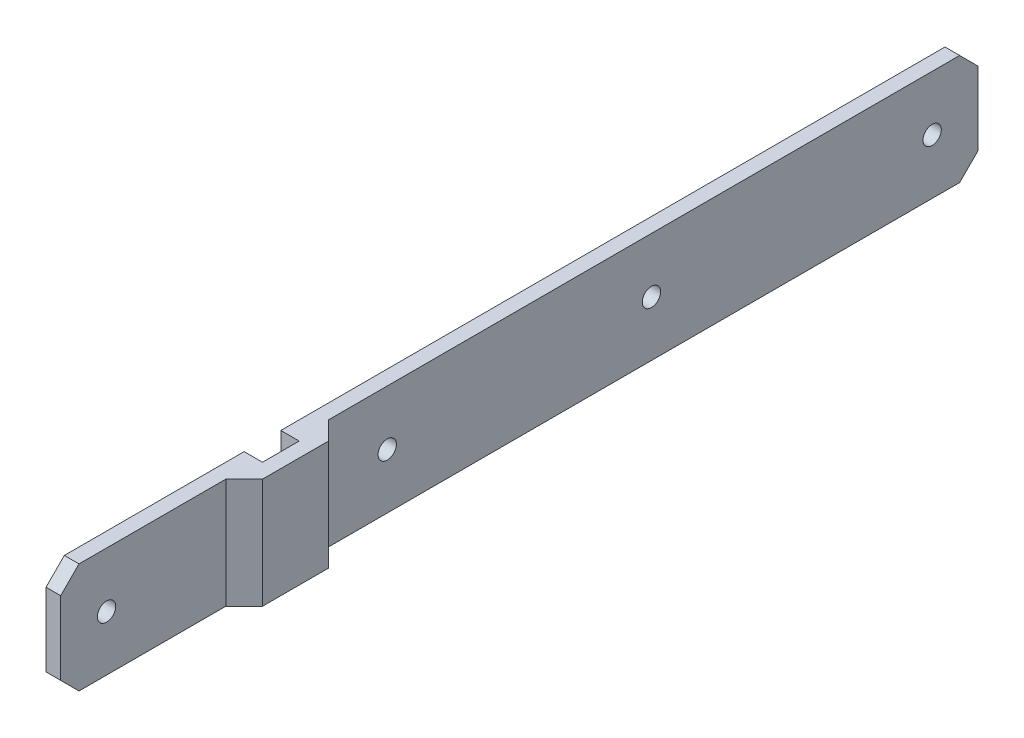
ISO-10303-21;
HEADER;
FILE_DESCRIPTION(('STEP AP214'),'2;1');
FILE_NAME('part.step','',(''),(''),'','','');
FILE_SCHEMA(('AUTOMOTIVE_DESIGN { 1 0 10303 214 1 1 1 1 }'));
ENDSEC;
DATA;
#1=APPLICATION_CONTEXT('core data for automotive mechanical design processes');
#2=APPLICATION_PROTOCOL_DEFINITION('international standard','automotive_design',2000,#1);
#3=PRODUCT_CONTEXT('',#1,'mechanical');
#4=PRODUCT('Part','Part','',(#3));
#5=PRODUCT_RELATED_PRODUCT_CATEGORY('part','',(#4));
#6=PRODUCT_DEFINITION_FORMATION('','',#4);
#7=PRODUCT_DEFINITION_CONTEXT('part definition',#1,'design');
#8=PRODUCT_DEFINITION('design','',#6,#7);
#9=PRODUCT_DEFINITION_SHAPE('','',#8);
#10=(LENGTH_UNIT() NAMED_UNIT(*) SI_UNIT(.MILLI.,.METRE.));
#11=(NAMED_UNIT(*) PLANE_ANGLE_UNIT() SI_UNIT($,.RADIAN.));
#12=(NAMED_UNIT(*) SI_UNIT($,.STERADIAN.) SOLID_ANGLE_UNIT());
#13=UNCERTAINTY_MEASURE_WITH_UNIT(LENGTH_MEASURE(1.E-05),#10,'distance_accuracy_value','');
#14=(GEOMETRIC_REPRESENTATION_CONTEXT(3) GLOBAL_UNCERTAINTY_ASSIGNED_CONTEXT((#13)) GLOBAL_UNIT_ASSIGNED_CONTEXT((#10,
#11,#12)) REPRESENTATION_CONTEXT('',''));
#15=CARTESIAN_POINT('',(0.,0.,0.));
#16=DIRECTION('',(0.,0.,1.));
#17=DIRECTION('',(1.,0.,0.));
#18=AXIS2_PLACEMENT_3D('',#15,#16,#17);
#19=CARTESIAN_POINT('',(5.,15.,0.));
#20=DIRECTION('',(0.,0.,-1.));
#21=DIRECTION('',(-1.,0.,0.));
#22=AXIS2_PLACEMENT_3D('',#19,#20,#21);
#23=PLANE('',#22);
#24=DIRECTION('',(1.,0.,0.));
#25=VECTOR('',#24,1.);
#26=CARTESIAN_POINT('',(5.,-15.,0.));
#27=LINE('',#26,#25);
#28=CARTESIAN_POINT('',(0.,-15.,0.));
#29=VERTEX_POINT('',#28);
#30=CARTESIAN_POINT('',(5.,-15.,0.));
#31=VERTEX_POINT('',#30);
#32=EDGE_CURVE('E184',#29,#31,#27,.T.);
#33=ORIENTED_EDGE('',*,*,#32,.T.);
#34=DIRECTION('',(0.,-1.,0.));
#35=VECTOR('',#34,1.);
#36=CARTESIAN_POINT('',(5.,15.,0.));
#37=LINE('',#36,#35);
#38=CARTESIAN_POINT('',(5.,15.,0.));
#39=VERTEX_POINT('',#38);
#40=EDGE_CURVE('E161',#39,#31,#37,.T.);
#41=ORIENTED_EDGE('',*,*,#40,.F.);
#42=DIRECTION('',(1.,0.,0.));
#43=VECTOR('',#42,1.);
#44=CARTESIAN_POINT('',(5.,15.,0.));
#45=LINE('',#44,#43);
#46=CARTESIAN_POINT('',(0.,15.,0.));
#47=VERTEX_POINT('',#46);
#48=EDGE_CURVE('E169',#47,#39,#45,.T.);
#49=ORIENTED_EDGE('',*,*,#48,.F.);
#50=DIRECTION('',(0.,-1.,0.));
#51=VECTOR('',#50,1.);
#52=CARTESIAN_POINT('',(0.,15.,0.));
#53=LINE('',#52,#51);
#54=EDGE_CURVE('E304',#47,#29,#53,.T.);
#55=ORIENTED_EDGE('',*,*,#54,.T.);
#56=EDGE_LOOP('',(#33,#41,#49,#55));
#57=FACE_BOUND('',#56,.T.);
#58=ADVANCED_FACE('F41',(#57),#23,.F.);
#59=CARTESIAN_POINT('',(5.,15.,10.));
#60=DIRECTION('',(1.,0.,0.));
#61=DIRECTION('',(0.,0.,-1.));
#62=AXIS2_PLACEMENT_3D('',#59,#60,#61);
#63=PLANE('',#62);
#64=DIRECTION('',(0.,0.,1.));
#65=VECTOR('',#64,1.);
#66=CARTESIAN_POINT('',(5.,-15.,10.));
#67=LINE('',#66,#65);
#68=CARTESIAN_POINT('',(5.,-15.,10.));
#69=VERTEX_POINT('',#68);
#70=EDGE_CURVE('E307',#31,#69,#67,.T.);
#71=ORIENTED_EDGE('',*,*,#70,.T.);
#72=DIRECTION('',(0.,-1.,0.));
#73=VECTOR('',#72,1.);
#74=CARTESIAN_POINT('',(5.,15.,10.));
#75=LINE('',#74,#73);
#76=CARTESIAN_POINT('',(5.,15.,10.));
#77=VERTEX_POINT('',#76);
#78=EDGE_CURVE('E164',#77,#69,#75,.T.);
#79=ORIENTED_EDGE('',*,*,#78,.F.);
#80=DIRECTION('',(0.,0.,1.));
#81=VECTOR('',#80,1.);
#82=CARTESIAN_POINT('',(5.,15.,10.));
#83=LINE('',#82,#81);
#84=EDGE_CURVE('E157',#39,#77,#83,.T.);
#85=ORIENTED_EDGE('',*,*,#84,.F.);
#86=ORIENTED_EDGE('',*,*,#40,.T.);
#87=EDGE_LOOP('',(#71,#79,#85,#86));
#88=FACE_BOUND('',#87,.T.);
#89=ADVANCED_FACE('F159',(#88),#63,.F.);
#90=CARTESIAN_POINT('',(0.,15.,10.));
#91=DIRECTION('',(0.,0.,1.));
#92=DIRECTION('',(1.,0.,0.));
#93=AXIS2_PLACEMENT_3D('',#90,#91,#92);
#94=PLANE('',#93);
#95=DIRECTION('',(-1.,0.,0.));
#96=VECTOR('',#95,1.);
#97=CARTESIAN_POINT('',(0.,-15.,10.));
#98=LINE('',#97,#96);
#99=CARTESIAN_POINT('',(0.,-15.,10.));
#100=VERTEX_POINT('',#99);
#101=EDGE_CURVE('E310',#69,#100,#98,.T.);
#102=ORIENTED_EDGE('',*,*,#101,.T.);
#103=DIRECTION('',(0.,-1.,0.));
#104=VECTOR('',#103,1.);
#105=CARTESIAN_POINT('',(0.,15.,10.));
#106=LINE('',#105,#104);
#107=CARTESIAN_POINT('',(0.,15.,10.));
#108=VERTEX_POINT('',#107);
#109=EDGE_CURVE('E192',#108,#100,#106,.T.);
#110=ORIENTED_EDGE('',*,*,#109,.F.);
#111=DIRECTION('',(-1.,0.,0.));
#112=VECTOR('',#111,1.);
#113=CARTESIAN_POINT('',(0.,15.,10.));
#114=LINE('',#113,#112);
#115=EDGE_CURVE('E168',#77,#108,#114,.T.);
#116=ORIENTED_EDGE('',*,*,#115,.F.);
#117=ORIENTED_EDGE('',*,*,#78,.T.);
#118=EDGE_LOOP('',(#102,#110,#116,#117));
#119=FACE_BOUND('',#118,.T.);
#120=ADVANCED_FACE('F414',(#119),#94,.F.);
#121=CARTESIAN_POINT('',(0.,15.,64.));
#122=DIRECTION('',(1.,0.,0.));
#123=DIRECTION('',(0.,0.,-1.));
#124=AXIS2_PLACEMENT_3D('',#121,#122,#123);
#125=PLANE('',#124);
#126=CARTESIAN_POINT('',(0.,0.,51.5));
#127=DIRECTION('',(1.,0.,0.));
#128=DIRECTION('',(0.,0.,-1.));
#129=AXIS2_PLACEMENT_3D('',#126,#127,#128);
#130=CIRCLE('',#129,2.5);
#131=CARTESIAN_POINT('',(0.,0.,49.));
#132=VERTEX_POINT('',#131);
#133=EDGE_CURVE('E374',#132,#132,#130,.T.);
#134=ORIENTED_EDGE('',*,*,#133,.T.);
#135=EDGE_LOOP('',(#134));
#136=FACE_BOUND('',#135,.T.);
#137=DIRECTION('',(0.,0.,1.));
#138=VECTOR('',#137,1.);
#139=CARTESIAN_POINT('',(0.,-15.,64.));
#140=LINE('',#139,#138);
#141=CARTESIAN_POINT('',(0.,-15.,59.));
#142=VERTEX_POINT('',#141);
#143=EDGE_CURVE('E279',#100,#142,#140,.T.);
#144=ORIENTED_EDGE('',*,*,#143,.T.);
#145=DIRECTION('',(0.,0.707106781186546,0.707106781186549));
#146=VECTOR('',#145,1.);
#147=CARTESIAN_POINT('',(0.,-10.,64.));
#148=LINE('',#147,#146);
#149=CARTESIAN_POINT('',(0.,-10.,64.));
#150=VERTEX_POINT('',#149);
#151=EDGE_CURVE('E58',#142,#150,#148,.T.);
#152=ORIENTED_EDGE('',*,*,#151,.T.);
#153=DIRECTION('',(0.,-1.,0.));
#154=VECTOR('',#153,1.);
#155=CARTESIAN_POINT('',(0.,15.,64.));
#156=LINE('',#155,#154);
#157=CARTESIAN_POINT('',(0.,9.99999999999999,64.));
#158=VERTEX_POINT('',#157);
#159=EDGE_CURVE('E340',#158,#150,#156,.T.);
#160=ORIENTED_EDGE('',*,*,#159,.F.);
#161=DIRECTION('',(0.,-0.707106781186549,0.707106781186546));
#162=VECTOR('',#161,1.);
#163=CARTESIAN_POINT('',(0.,15.,59.));
#164=LINE('',#163,#162);
#165=CARTESIAN_POINT('',(0.,15.,59.));
#166=VERTEX_POINT('',#165);
#167=EDGE_CURVE('E248',#158,#166,#164,.F.);
#168=ORIENTED_EDGE('',*,*,#167,.T.);
#169=DIRECTION('',(0.,0.,1.));
#170=VECTOR('',#169,1.);
#171=CARTESIAN_POINT('',(0.,15.,64.));
#172=LINE('',#171,#170);
#173=EDGE_CURVE('E298',#108,#166,#172,.T.);
#174=ORIENTED_EDGE('',*,*,#173,.F.);
#175=ORIENTED_EDGE('',*,*,#109,.T.);
#176=EDGE_LOOP('',(#144,#152,#160,#168,#174,#175));
#177=FACE_BOUND('',#176,.T.);
#178=ADVANCED_FACE('F347',(#136,#177),#125,.F.);
#179=CARTESIAN_POINT('',(4.00000000000001,15.,64.));
#180=DIRECTION('',(0.,0.,-1.));
#181=DIRECTION('',(-1.,0.,0.));
#182=AXIS2_PLACEMENT_3D('',#179,#180,#181);
#183=PLANE('',#182);
#184=ORIENTED_EDGE('',*,*,#159,.T.);
#185=DIRECTION('',(1.,0.,0.));
#186=VECTOR('',#185,1.);
#187=CARTESIAN_POINT('',(4.00000000000001,-10.,64.));
#188=LINE('',#187,#186);
#189=CARTESIAN_POINT('',(4.00000000000001,-10.,64.));
#190=VERTEX_POINT('',#189);
#191=EDGE_CURVE('E235',#150,#190,#188,.T.);
#192=ORIENTED_EDGE('',*,*,#191,.T.);
#193=DIRECTION('',(0.,-1.,0.));
#194=VECTOR('',#193,1.);
#195=CARTESIAN_POINT('',(4.00000000000001,15.,64.));
#196=LINE('',#195,#194);
#197=CARTESIAN_POINT('',(4.00000000000001,9.99999999999999,64.));
#198=VERTEX_POINT('',#197);
#199=EDGE_CURVE('E337',#198,#190,#196,.T.);
#200=ORIENTED_EDGE('',*,*,#199,.F.);
#201=DIRECTION('',(-1.,0.,0.));
#202=VECTOR('',#201,1.);
#203=CARTESIAN_POINT('',(4.00000000000001,9.99999999999999,64.));
#204=LINE('',#203,#202);
#205=EDGE_CURVE('E65',#198,#158,#204,.T.);
#206=ORIENTED_EDGE('',*,*,#205,.T.);
#207=EDGE_LOOP('',(#184,#192,#200,#206));
#208=FACE_BOUND('',#207,.T.);
#209=ADVANCED_FACE('F354',(#208),#183,.F.);
#210=CARTESIAN_POINT('',(4.,15.,14.));
#211=DIRECTION('',(-1.,0.,0.));
#212=DIRECTION('',(0.,0.,1.));
#213=AXIS2_PLACEMENT_3D('',#210,#211,#212);
#214=PLANE('',#213);
#215=CARTESIAN_POINT('',(4.,0.,51.5));
#216=DIRECTION('',(-1.,0.,0.));
#217=DIRECTION('',(0.,0.,1.));
#218=AXIS2_PLACEMENT_3D('',#215,#216,#217);
#219=CIRCLE('',#218,2.5);
#220=CARTESIAN_POINT('',(4.,0.,54.));
#221=VERTEX_POINT('',#220);
#222=EDGE_CURVE('E196',#221,#221,#219,.F.);
#223=ORIENTED_EDGE('',*,*,#222,.F.);
#224=EDGE_LOOP('',(#223));
#225=FACE_BOUND('',#224,.T.);
#226=ORIENTED_EDGE('',*,*,#199,.T.);
#227=DIRECTION('',(0.,-0.707106781186546,-0.707106781186549));
#228=VECTOR('',#227,1.);
#229=CARTESIAN_POINT('',(4.00000000000001,-10.,64.));
#230=LINE('',#229,#228);
#231=CARTESIAN_POINT('',(4.00000000000001,-15.,59.));
#232=VERTEX_POINT('',#231);
#233=EDGE_CURVE('E245',#190,#232,#230,.T.);
#234=ORIENTED_EDGE('',*,*,#233,.T.);
#235=DIRECTION('',(0.,0.,-1.));
#236=VECTOR('',#235,1.);
#237=CARTESIAN_POINT('',(4.,-15.,14.));
#238=LINE('',#237,#236);
#239=CARTESIAN_POINT('',(4.,-15.,18.9999999999999));
#240=VERTEX_POINT('',#239);
#241=EDGE_CURVE('E265',#232,#240,#238,.T.);
#242=ORIENTED_EDGE('',*,*,#241,.T.);
#243=DIRECTION('',(0.,1.,0.));
#244=VECTOR('',#243,1.);
#245=CARTESIAN_POINT('',(4.,15.,18.9999999999999));
#246=LINE('',#245,#244);
#247=CARTESIAN_POINT('',(4.,15.,18.9999999999999));
#248=VERTEX_POINT('',#247);
#249=EDGE_CURVE('E239',#240,#248,#246,.T.);
#250=ORIENTED_EDGE('',*,*,#249,.T.);
#251=DIRECTION('',(0.,0.,-1.));
#252=VECTOR('',#251,1.);
#253=CARTESIAN_POINT('',(4.,15.,14.));
#254=LINE('',#253,#252);
#255=CARTESIAN_POINT('',(4.00000000000001,15.,59.));
#256=VERTEX_POINT('',#255);
#257=EDGE_CURVE('E286',#256,#248,#254,.T.);
#258=ORIENTED_EDGE('',*,*,#257,.F.);
#259=DIRECTION('',(0.,0.707106781186549,-0.707106781186546));
#260=VECTOR('',#259,1.);
#261=CARTESIAN_POINT('',(4.00000000000001,15.,59.));
#262=LINE('',#261,#260);
#263=EDGE_CURVE('E242',#256,#198,#262,.F.);
#264=ORIENTED_EDGE('',*,*,#263,.T.);
#265=EDGE_LOOP('',(#226,#234,#242,#250,#258,#264));
#266=FACE_BOUND('',#265,.T.);
#267=ADVANCED_FACE('F275',(#225,#266),#214,.F.);
#268=CARTESIAN_POINT('',(9.,15.,-4.));
#269=DIRECTION('',(-1.,0.,0.));
#270=DIRECTION('',(0.,0.,1.));
#271=AXIS2_PLACEMENT_3D('',#268,#269,#270);
#272=PLANE('',#271);
#273=DIRECTION('',(0.,0.,-1.));
#274=VECTOR('',#273,1.);
#275=CARTESIAN_POINT('',(9.,-15.,-4.));
#276=LINE('',#275,#274);
#277=CARTESIAN_POINT('',(9.,-15.,14.));
#278=VERTEX_POINT('',#277);
#279=CARTESIAN_POINT('',(9.,-15.,-4.));
#280=VERTEX_POINT('',#279);
#281=EDGE_CURVE('E268',#278,#280,#276,.T.);
#282=ORIENTED_EDGE('',*,*,#281,.T.);
#283=DIRECTION('',(0.,-1.,0.));
#284=VECTOR('',#283,1.);
#285=CARTESIAN_POINT('',(9.,15.,-4.));
#286=LINE('',#285,#284);
#287=CARTESIAN_POINT('',(9.,15.,-4.));
#288=VERTEX_POINT('',#287);
#289=EDGE_CURVE('E290',#288,#280,#286,.T.);
#290=ORIENTED_EDGE('',*,*,#289,.F.);
#291=DIRECTION('',(0.,0.,-1.));
#292=VECTOR('',#291,1.);
#293=CARTESIAN_POINT('',(9.,15.,-4.));
#294=LINE('',#293,#292);
#295=CARTESIAN_POINT('',(9.,15.,14.));
#296=VERTEX_POINT('',#295);
#297=EDGE_CURVE('E284',#296,#288,#294,.T.);
#298=ORIENTED_EDGE('',*,*,#297,.F.);
#299=DIRECTION('',(0.,-1.,0.));
#300=VECTOR('',#299,1.);
#301=CARTESIAN_POINT('',(9.,15.,14.));
#302=LINE('',#301,#300);
#303=EDGE_CURVE('E282',#296,#278,#302,.T.);
#304=ORIENTED_EDGE('',*,*,#303,.T.);
#305=EDGE_LOOP('',(#282,#290,#298,#304));
#306=FACE_BOUND('',#305,.T.);
#307=ADVANCED_FACE('F288',(#306),#272,.F.);
#308=CARTESIAN_POINT('',(3.99999999999999,15.,-186.));
#309=DIRECTION('',(-1.,0.,0.));
#310=DIRECTION('',(0.,0.,1.));
#311=AXIS2_PLACEMENT_3D('',#308,#309,#310);
#312=PLANE('',#311);
#313=CARTESIAN_POINT('',(4.,0.,-25.));
#314=DIRECTION('',(-1.,0.,0.));
#315=DIRECTION('',(0.,0.,1.));
#316=AXIS2_PLACEMENT_3D('',#313,#314,#315);
#317=CIRCLE('',#316,2.5);
#318=CARTESIAN_POINT('',(4.,0.,-22.5));
#319=VERTEX_POINT('',#318);
#320=EDGE_CURVE('E199',#319,#319,#317,.F.);
#321=ORIENTED_EDGE('',*,*,#320,.F.);
#322=EDGE_LOOP('',(#321));
#323=FACE_BOUND('',#322,.T.);
#324=CARTESIAN_POINT('',(4.,0.,-97.));
#325=DIRECTION('',(-1.,0.,0.));
#326=DIRECTION('',(0.,0.,1.));
#327=AXIS2_PLACEMENT_3D('',#324,#325,#326);
#328=CIRCLE('',#327,2.5);
#329=CARTESIAN_POINT('',(4.,0.,-94.5));
#330=VERTEX_POINT('',#329);
#331=EDGE_CURVE('E366',#330,#330,#328,.F.);
#332=ORIENTED_EDGE('',*,*,#331,.F.);
#333=EDGE_LOOP('',(#332));
#334=FACE_BOUND('',#333,.T.);
#335=CARTESIAN_POINT('',(3.99999999999999,0.,-173.5));
#336=DIRECTION('',(-1.,0.,0.));
#337=DIRECTION('',(0.,0.,1.));
#338=AXIS2_PLACEMENT_3D('',#335,#336,#337);
#339=CIRCLE('',#338,2.5);
#340=CARTESIAN_POINT('',(3.99999999999999,0.,-171.));
#341=VERTEX_POINT('',#340);
#342=EDGE_CURVE('E370',#341,#341,#339,.F.);
#343=ORIENTED_EDGE('',*,*,#342,.F.);
#344=EDGE_LOOP('',(#343));
#345=FACE_BOUND('',#344,.T.);
#346=DIRECTION('',(0.,0.,-1.));
#347=VECTOR('',#346,1.);
#348=CARTESIAN_POINT('',(3.99999999999999,-15.,-186.));
#349=LINE('',#348,#347);
#350=CARTESIAN_POINT('',(4.00000000000001,-15.,-8.99999999999998));
#351=VERTEX_POINT('',#350);
#352=CARTESIAN_POINT('',(3.99999999999999,-15.,-181.));
#353=VERTEX_POINT('',#352);
#354=EDGE_CURVE('E317',#351,#353,#349,.T.);
#355=ORIENTED_EDGE('',*,*,#354,.T.);
#356=DIRECTION('',(0.,0.707106781186546,-0.707106781186549));
#357=VECTOR('',#356,1.);
#358=CARTESIAN_POINT('',(3.99999999999999,-10.,-186.));
#359=LINE('',#358,#357);
#360=CARTESIAN_POINT('',(3.99999999999999,-10.,-186.));
#361=VERTEX_POINT('',#360);
#362=EDGE_CURVE('E223',#353,#361,#359,.T.);
#363=ORIENTED_EDGE('',*,*,#362,.T.);
#364=DIRECTION('',(0.,-1.,0.));
#365=VECTOR('',#364,1.);
#366=CARTESIAN_POINT('',(3.99999999999999,15.,-186.));
#367=LINE('',#366,#365);
#368=CARTESIAN_POINT('',(3.99999999999999,9.99999999999999,-186.));
#369=VERTEX_POINT('',#368);
#370=EDGE_CURVE('E329',#369,#361,#367,.T.);
#371=ORIENTED_EDGE('',*,*,#370,.F.);
#372=DIRECTION('',(0.,-0.707106781186551,-0.707106781186544));
#373=VECTOR('',#372,1.);
#374=CARTESIAN_POINT('',(3.99999999999999,15.,-181.));
#375=LINE('',#374,#373);
#376=CARTESIAN_POINT('',(3.99999999999999,15.,-181.));
#377=VERTEX_POINT('',#376);
#378=EDGE_CURVE('E220',#369,#377,#375,.F.);
#379=ORIENTED_EDGE('',*,*,#378,.T.);
#380=DIRECTION('',(0.,0.,-1.));
#381=VECTOR('',#380,1.);
#382=CARTESIAN_POINT('',(3.99999999999999,15.,-186.));
#383=LINE('',#382,#381);
#384=CARTESIAN_POINT('',(4.00000000000001,15.,-8.99999999999998));
#385=VERTEX_POINT('',#384);
#386=EDGE_CURVE('E293',#385,#377,#383,.T.);
#387=ORIENTED_EDGE('',*,*,#386,.F.);
#388=DIRECTION('',(0.,-1.,0.));
#389=VECTOR('',#388,1.);
#390=CARTESIAN_POINT('',(4.00000000000001,-15.,-8.99999999999998));
#391=LINE('',#390,#389);
#392=EDGE_CURVE('E216',#385,#351,#391,.T.);
#393=ORIENTED_EDGE('',*,*,#392,.T.);
#394=EDGE_LOOP('',(#355,#363,#371,#379,#387,#393));
#395=FACE_BOUND('',#394,.T.);
#396=ADVANCED_FACE('F406',(#323,#334,#345,#395),#312,.F.);
#397=CARTESIAN_POINT('',(0.,15.,-186.));
#398=DIRECTION('',(0.,0.,1.));
#399=DIRECTION('',(1.,0.,0.));
#400=AXIS2_PLACEMENT_3D('',#397,#398,#399);
#401=PLANE('',#400);
#402=ORIENTED_EDGE('',*,*,#370,.T.);
#403=DIRECTION('',(-1.,0.,0.));
#404=VECTOR('',#403,1.);
#405=CARTESIAN_POINT('',(0.,-10.,-186.));
#406=LINE('',#405,#404);
#407=CARTESIAN_POINT('',(0.,-10.,-186.));
#408=VERTEX_POINT('',#407);
#409=EDGE_CURVE('E190',#361,#408,#406,.T.);
#410=ORIENTED_EDGE('',*,*,#409,.T.);
#411=DIRECTION('',(0.,-1.,0.));
#412=VECTOR('',#411,1.);
#413=CARTESIAN_POINT('',(0.,15.,-186.));
#414=LINE('',#413,#412);
#415=CARTESIAN_POINT('',(0.,9.99999999999999,-186.));
#416=VERTEX_POINT('',#415);
#417=EDGE_CURVE('E325',#416,#408,#414,.T.);
#418=ORIENTED_EDGE('',*,*,#417,.F.);
#419=DIRECTION('',(1.,0.,0.));
#420=VECTOR('',#419,1.);
#421=CARTESIAN_POINT('',(0.,9.99999999999999,-186.));
#422=LINE('',#421,#420);
#423=EDGE_CURVE('E186',#416,#369,#422,.T.);
#424=ORIENTED_EDGE('',*,*,#423,.T.);
#425=EDGE_LOOP('',(#402,#410,#418,#424));
#426=FACE_BOUND('',#425,.T.);
#427=ADVANCED_FACE('F492',(#426),#401,.F.);
#428=CARTESIAN_POINT('',(0.,15.,0.));
#429=DIRECTION('',(1.,0.,0.));
#430=DIRECTION('',(0.,0.,-1.));
#431=AXIS2_PLACEMENT_3D('',#428,#429,#430);
#432=PLANE('',#431);
#433=CARTESIAN_POINT('',(0.,0.,-25.));
#434=DIRECTION('',(1.,0.,0.));
#435=DIRECTION('',(0.,0.,-1.));
#436=AXIS2_PLACEMENT_3D('',#433,#434,#435);
#437=CIRCLE('',#436,2.5);
#438=CARTESIAN_POINT('',(0.,0.,-27.5));
#439=VERTEX_POINT('',#438);
#440=EDGE_CURVE('E383',#439,#439,#437,.T.);
#441=ORIENTED_EDGE('',*,*,#440,.T.);
#442=EDGE_LOOP('',(#441));
#443=FACE_BOUND('',#442,.T.);
#444=CARTESIAN_POINT('',(0.,0.,-97.));
#445=DIRECTION('',(1.,0.,0.));
#446=DIRECTION('',(0.,0.,-1.));
#447=AXIS2_PLACEMENT_3D('',#444,#445,#446);
#448=CIRCLE('',#447,2.5);
#449=CARTESIAN_POINT('',(0.,0.,-99.5));
#450=VERTEX_POINT('',#449);
#451=EDGE_CURVE('E379',#450,#450,#448,.T.);
#452=ORIENTED_EDGE('',*,*,#451,.T.);
#453=EDGE_LOOP('',(#452));
#454=FACE_BOUND('',#453,.T.);
#455=CARTESIAN_POINT('',(0.,0.,-173.5));
#456=DIRECTION('',(1.,0.,0.));
#457=DIRECTION('',(0.,0.,-1.));
#458=AXIS2_PLACEMENT_3D('',#455,#456,#457);
#459=CIRCLE('',#458,2.5);
#460=CARTESIAN_POINT('',(0.,0.,-176.));
#461=VERTEX_POINT('',#460);
#462=EDGE_CURVE('E375',#461,#461,#459,.T.);
#463=ORIENTED_EDGE('',*,*,#462,.T.);
#464=EDGE_LOOP('',(#463));
#465=FACE_BOUND('',#464,.T.);
#466=ORIENTED_EDGE('',*,*,#417,.T.);
#467=DIRECTION('',(0.,-0.707106781186546,0.707106781186549));
#468=VECTOR('',#467,1.);
#469=CARTESIAN_POINT('',(0.,-10.,-186.));
#470=LINE('',#469,#468);
#471=CARTESIAN_POINT('',(0.,-15.,-181.));
#472=VERTEX_POINT('',#471);
#473=EDGE_CURVE('E207',#408,#472,#470,.T.);
#474=ORIENTED_EDGE('',*,*,#473,.T.);
#475=DIRECTION('',(0.,0.,1.));
#476=VECTOR('',#475,1.);
#477=CARTESIAN_POINT('',(0.,-15.,0.));
#478=LINE('',#477,#476);
#479=EDGE_CURVE('E181',#472,#29,#478,.T.);
#480=ORIENTED_EDGE('',*,*,#479,.T.);
#481=ORIENTED_EDGE('',*,*,#54,.F.);
#482=DIRECTION('',(0.,0.,1.));
#483=VECTOR('',#482,1.);
#484=CARTESIAN_POINT('',(0.,15.,0.));
#485=LINE('',#484,#483);
#486=CARTESIAN_POINT('',(0.,15.,-181.));
#487=VERTEX_POINT('',#486);
#488=EDGE_CURVE('E176',#487,#47,#485,.T.);
#489=ORIENTED_EDGE('',*,*,#488,.F.);
#490=DIRECTION('',(0.,0.707106781186551,0.707106781186544));
#491=VECTOR('',#490,1.);
#492=CARTESIAN_POINT('',(0.,15.,-181.));
#493=LINE('',#492,#491);
#494=EDGE_CURVE('E204',#487,#416,#493,.F.);
#495=ORIENTED_EDGE('',*,*,#494,.T.);
#496=EDGE_LOOP('',(#466,#474,#480,#481,#489,#495));
#497=FACE_BOUND('',#496,.T.);
#498=ADVANCED_FACE('F458',(#443,#454,#465,#497),#432,.F.);
#499=CARTESIAN_POINT('',(0.,15.,0.));
#500=DIRECTION('',(0.,-1.,0.));
#501=DIRECTION('',(0.,0.,-1.));
#502=AXIS2_PLACEMENT_3D('',#499,#500,#501);
#503=PLANE('',#502);
#504=ORIENTED_EDGE('',*,*,#386,.T.);
#505=DIRECTION('',(-1.,0.,0.));
#506=VECTOR('',#505,1.);
#507=CARTESIAN_POINT('',(0.,15.,-181.));
#508=LINE('',#507,#506);
#509=EDGE_CURVE('E230',#377,#487,#508,.T.);
#510=ORIENTED_EDGE('',*,*,#509,.T.);
#511=ORIENTED_EDGE('',*,*,#488,.T.);
#512=ORIENTED_EDGE('',*,*,#48,.T.);
#513=ORIENTED_EDGE('',*,*,#84,.T.);
#514=ORIENTED_EDGE('',*,*,#115,.T.);
#515=ORIENTED_EDGE('',*,*,#173,.T.);
#516=DIRECTION('',(1.,0.,0.));
#517=VECTOR('',#516,1.);
#518=CARTESIAN_POINT('',(0.,15.,59.));
#519=LINE('',#518,#517);
#520=EDGE_CURVE('E226',#166,#256,#519,.T.);
#521=ORIENTED_EDGE('',*,*,#520,.T.);
#522=ORIENTED_EDGE('',*,*,#257,.T.);
#523=DIRECTION('',(-0.707106781186553,0.,0.707106781186542));
#524=VECTOR('',#523,1.);
#525=CARTESIAN_POINT('',(11.4999999999999,15.,11.5000000000001));
#526=LINE('',#525,#524);
#527=EDGE_CURVE('E11',#248,#296,#526,.F.);
#528=ORIENTED_EDGE('',*,*,#527,.T.);
#529=ORIENTED_EDGE('',*,*,#297,.T.);
#530=DIRECTION('',(0.707106781186543,0.,0.707106781186552));
#531=VECTOR('',#530,1.);
#532=CARTESIAN_POINT('',(6.50000000000002,15.,-6.49999999999994));
#533=LINE('',#532,#531);
#534=EDGE_CURVE('E256',#288,#385,#533,.F.);
#535=ORIENTED_EDGE('',*,*,#534,.T.);
#536=EDGE_LOOP('',(#504,#510,#511,#512,#513,#514,#515,#521,#522,#528,#529,#535));
#537=FACE_BOUND('',#536,.T.);
#538=ADVANCED_FACE('F173',(#537),#503,.F.);
#539=CARTESIAN_POINT('',(0.,-15.,0.));
#540=DIRECTION('',(0.,-1.,0.));
#541=DIRECTION('',(0.,0.,-1.));
#542=AXIS2_PLACEMENT_3D('',#539,#540,#541);
#543=PLANE('',#542);
#544=ORIENTED_EDGE('',*,*,#479,.F.);
#545=DIRECTION('',(1.,0.,0.));
#546=VECTOR('',#545,1.);
#547=CARTESIAN_POINT('',(3.99999999999999,-15.,-181.));
#548=LINE('',#547,#546);
#549=EDGE_CURVE('E213',#472,#353,#548,.T.);
#550=ORIENTED_EDGE('',*,*,#549,.T.);
#551=ORIENTED_EDGE('',*,*,#354,.F.);
#552=DIRECTION('',(-0.707106781186543,0.,-0.707106781186552));
#553=VECTOR('',#552,1.);
#554=CARTESIAN_POINT('',(4.00000000000001,-15.,-8.99999999999998));
#555=LINE('',#554,#553);
#556=EDGE_CURVE('E253',#351,#280,#555,.F.);
#557=ORIENTED_EDGE('',*,*,#556,.T.);
#558=ORIENTED_EDGE('',*,*,#281,.F.);
#559=DIRECTION('',(0.707106781186553,0.,-0.707106781186542));
#560=VECTOR('',#559,1.);
#561=CARTESIAN_POINT('',(9.,-15.,14.));
#562=LINE('',#561,#560);
#563=EDGE_CURVE('E51',#278,#240,#562,.F.);
#564=ORIENTED_EDGE('',*,*,#563,.T.);
#565=ORIENTED_EDGE('',*,*,#241,.F.);
#566=DIRECTION('',(-1.,0.,0.));
#567=VECTOR('',#566,1.);
#568=CARTESIAN_POINT('',(0.,-15.,59.));
#569=LINE('',#568,#567);
#570=EDGE_CURVE('E210',#232,#142,#569,.T.);
#571=ORIENTED_EDGE('',*,*,#570,.T.);
#572=ORIENTED_EDGE('',*,*,#143,.F.);
#573=ORIENTED_EDGE('',*,*,#101,.F.);
#574=ORIENTED_EDGE('',*,*,#70,.F.);
#575=ORIENTED_EDGE('',*,*,#32,.F.);
#576=EDGE_LOOP('',(#544,#550,#551,#557,#558,#564,#565,#571,#572,#573,#574,#575));
#577=FACE_BOUND('',#576,.T.);
#578=ADVANCED_FACE('F264',(#577),#543,.T.);
#579=CARTESIAN_POINT('',(30.,0.,-173.5));
#580=DIRECTION('',(-1.,0.,0.));
#581=DIRECTION('',(0.,0.,1.));
#582=AXIS2_PLACEMENT_3D('',#579,#580,#581);
#583=CYLINDRICAL_SURFACE('',#582,2.5);
#584=ORIENTED_EDGE('',*,*,#462,.F.);
#585=EDGE_LOOP('',(#584));
#586=FACE_BOUND('',#585,.T.);
#587=ORIENTED_EDGE('',*,*,#342,.T.);
#588=EDGE_LOOP('',(#587));
#589=FACE_BOUND('',#588,.T.);
#590=ADVANCED_FACE('F528',(#586,#589),#583,.F.);
#591=CARTESIAN_POINT('',(30.,0.,-97.));
#592=DIRECTION('',(-1.,0.,0.));
#593=DIRECTION('',(0.,0.,1.));
#594=AXIS2_PLACEMENT_3D('',#591,#592,#593);
#595=CYLINDRICAL_SURFACE('',#594,2.5);
#596=ORIENTED_EDGE('',*,*,#451,.F.);
#597=EDGE_LOOP('',(#596));
#598=FACE_BOUND('',#597,.T.);
#599=ORIENTED_EDGE('',*,*,#331,.T.);
#600=EDGE_LOOP('',(#599));
#601=FACE_BOUND('',#600,.T.);
#602=ADVANCED_FACE('F575',(#598,#601),#595,.F.);
#603=CARTESIAN_POINT('',(30.,0.,-25.));
#604=DIRECTION('',(-1.,0.,0.));
#605=DIRECTION('',(0.,0.,1.));
#606=AXIS2_PLACEMENT_3D('',#603,#604,#605);
#607=CYLINDRICAL_SURFACE('',#606,2.5);
#608=ORIENTED_EDGE('',*,*,#440,.F.);
#609=EDGE_LOOP('',(#608));
#610=FACE_BOUND('',#609,.T.);
#611=ORIENTED_EDGE('',*,*,#320,.T.);
#612=EDGE_LOOP('',(#611));
#613=FACE_BOUND('',#612,.T.);
#614=ADVANCED_FACE('F396',(#610,#613),#607,.F.);
#615=CARTESIAN_POINT('',(30.,0.,51.5));
#616=DIRECTION('',(-1.,0.,0.));
#617=DIRECTION('',(0.,0.,1.));
#618=AXIS2_PLACEMENT_3D('',#615,#616,#617);
#619=CYLINDRICAL_SURFACE('',#618,2.5);
#620=ORIENTED_EDGE('',*,*,#133,.F.);
#621=EDGE_LOOP('',(#620));
#622=FACE_BOUND('',#621,.T.);
#623=ORIENTED_EDGE('',*,*,#222,.T.);
#624=EDGE_LOOP('',(#623));
#625=FACE_BOUND('',#624,.T.);
#626=ADVANCED_FACE('F392',(#622,#625),#619,.F.);
#627=CARTESIAN_POINT('',(0.,-10.,-186.));
#628=DIRECTION('',(0.,-0.707106781186549,-0.707106781186546));
#629=DIRECTION('',(1.,0.,0.));
#630=AXIS2_PLACEMENT_3D('',#627,#628,#629);
#631=PLANE('',#630);
#632=ORIENTED_EDGE('',*,*,#362,.F.);
#633=ORIENTED_EDGE('',*,*,#549,.F.);
#634=ORIENTED_EDGE('',*,*,#473,.F.);
#635=ORIENTED_EDGE('',*,*,#409,.F.);
#636=EDGE_LOOP('',(#632,#633,#634,#635));
#637=FACE_BOUND('',#636,.T.);
#638=ADVANCED_FACE('F395',(#637),#631,.T.);
#639=CARTESIAN_POINT('',(0.,15.,-181.));
#640=DIRECTION('',(0.,-0.707106781186544,0.707106781186551));
#641=DIRECTION('',(-1.,0.,0.));
#642=AXIS2_PLACEMENT_3D('',#639,#640,#641);
#643=PLANE('',#642);
#644=ORIENTED_EDGE('',*,*,#378,.F.);
#645=ORIENTED_EDGE('',*,*,#423,.F.);
#646=ORIENTED_EDGE('',*,*,#494,.F.);
#647=ORIENTED_EDGE('',*,*,#509,.F.);
#648=EDGE_LOOP('',(#644,#645,#646,#647));
#649=FACE_BOUND('',#648,.T.);
#650=ADVANCED_FACE('F424',(#649),#643,.F.);
#651=CARTESIAN_POINT('',(4.00000000000001,-10.,64.));
#652=DIRECTION('',(0.,-0.707106781186549,0.707106781186546));
#653=DIRECTION('',(-1.,0.,0.));
#654=AXIS2_PLACEMENT_3D('',#651,#652,#653);
#655=PLANE('',#654);
#656=ORIENTED_EDGE('',*,*,#151,.F.);
#657=ORIENTED_EDGE('',*,*,#570,.F.);
#658=ORIENTED_EDGE('',*,*,#233,.F.);
#659=ORIENTED_EDGE('',*,*,#191,.F.);
#660=EDGE_LOOP('',(#656,#657,#658,#659));
#661=FACE_BOUND('',#660,.T.);
#662=ADVANCED_FACE('F352',(#661),#655,.T.);
#663=CARTESIAN_POINT('',(0.,15.,59.));
#664=DIRECTION('',(0.,-0.707106781186546,-0.707106781186549));
#665=DIRECTION('',(1.,0.,0.));
#666=AXIS2_PLACEMENT_3D('',#663,#664,#665);
#667=PLANE('',#666);
#668=ORIENTED_EDGE('',*,*,#167,.F.);
#669=ORIENTED_EDGE('',*,*,#205,.F.);
#670=ORIENTED_EDGE('',*,*,#263,.F.);
#671=ORIENTED_EDGE('',*,*,#520,.F.);
#672=EDGE_LOOP('',(#668,#669,#670,#671));
#673=FACE_BOUND('',#672,.T.);
#674=ADVANCED_FACE('F358',(#673),#667,.F.);
#675=CARTESIAN_POINT('',(4.00000000000001,15.,-8.99999999999998));
#676=DIRECTION('',(0.707106781186552,0.,-0.707106781186543));
#677=DIRECTION('',(0.,1.,0.));
#678=AXIS2_PLACEMENT_3D('',#675,#676,#677);
#679=PLANE('',#678);
#680=ORIENTED_EDGE('',*,*,#534,.F.);
#681=ORIENTED_EDGE('',*,*,#289,.T.);
#682=ORIENTED_EDGE('',*,*,#556,.F.);
#683=ORIENTED_EDGE('',*,*,#392,.F.);
#684=EDGE_LOOP('',(#680,#681,#682,#683));
#685=FACE_BOUND('',#684,.T.);
#686=ADVANCED_FACE('F441',(#685),#679,.T.);
#687=CARTESIAN_POINT('',(9.,15.,14.));
#688=DIRECTION('',(0.707106781186542,0.,0.707106781186553));
#689=DIRECTION('',(0.,1.,0.));
#690=AXIS2_PLACEMENT_3D('',#687,#688,#689);
#691=PLANE('',#690);
#692=ORIENTED_EDGE('',*,*,#527,.F.);
#693=ORIENTED_EDGE('',*,*,#249,.F.);
#694=ORIENTED_EDGE('',*,*,#563,.F.);
#695=ORIENTED_EDGE('',*,*,#303,.F.);
#696=EDGE_LOOP('',(#692,#693,#694,#695));
#697=FACE_BOUND('',#696,.T.);
#698=ADVANCED_FACE('F44',(#697),#691,.T.);
#699=CLOSED_SHELL('',(#58,#89,#120,#178,#209,#267,#307,#396,#427,#498,#538,#578,#590,#602,#614,
#626,#638,#650,#662,#674,#686,#698));
#700=MANIFOLD_SOLID_BREP('B2',#699);
#701=ADVANCED_BREP_SHAPE_REPRESENTATION('',(#18,#700),#14);
#702=SHAPE_DEFINITION_REPRESENTATION(#9,#701);
ENDSEC;
END-ISO-10303-21;
